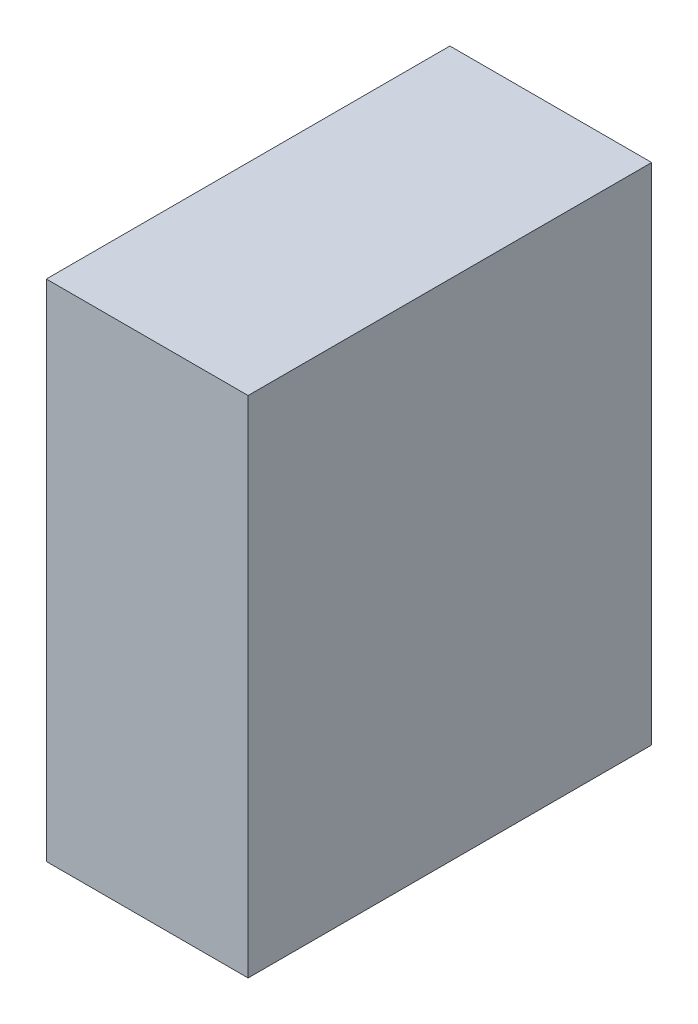
ISO-10303-21;
HEADER;
FILE_DESCRIPTION(('STEP AP214'),'2;1');
FILE_NAME('part.step','',(''),(''),'','','');
FILE_SCHEMA(('AUTOMOTIVE_DESIGN { 1 0 10303 214 1 1 1 1 }'));
ENDSEC;
DATA;
#1=APPLICATION_CONTEXT('core data for automotive mechanical design processes');
#2=APPLICATION_PROTOCOL_DEFINITION('international standard','automotive_design',2000,#1);
#3=PRODUCT_CONTEXT('',#1,'mechanical');
#4=PRODUCT('Part','Part','',(#3));
#5=PRODUCT_RELATED_PRODUCT_CATEGORY('part','',(#4));
#6=PRODUCT_DEFINITION_FORMATION('','',#4);
#7=PRODUCT_DEFINITION_CONTEXT('part definition',#1,'design');
#8=PRODUCT_DEFINITION('design','',#6,#7);
#9=PRODUCT_DEFINITION_SHAPE('','',#8);
#10=(LENGTH_UNIT() NAMED_UNIT(*) SI_UNIT(.MILLI.,.METRE.));
#11=(NAMED_UNIT(*) PLANE_ANGLE_UNIT() SI_UNIT($,.RADIAN.));
#12=(NAMED_UNIT(*) SI_UNIT($,.STERADIAN.) SOLID_ANGLE_UNIT());
#13=UNCERTAINTY_MEASURE_WITH_UNIT(LENGTH_MEASURE(1.E-05),#10,'distance_accuracy_value','');
#14=(GEOMETRIC_REPRESENTATION_CONTEXT(3) GLOBAL_UNCERTAINTY_ASSIGNED_CONTEXT((#13)) GLOBAL_UNIT_ASSIGNED_CONTEXT((#10,
#11,#12)) REPRESENTATION_CONTEXT('',''));
#15=CARTESIAN_POINT('',(0.,0.,0.));
#16=DIRECTION('',(0.,0.,1.));
#17=DIRECTION('',(1.,0.,0.));
#18=AXIS2_PLACEMENT_3D('',#15,#16,#17);
#19=CARTESIAN_POINT('',(-0.1999996,-0.499999,0.));
#20=DIRECTION('',(-1.,0.,0.));
#21=DIRECTION('',(0.,0.,1.));
#22=AXIS2_PLACEMENT_3D('',#19,#20,#21);
#23=PLANE('',#22);
#24=DIRECTION('',(0.,0.,1.));
#25=VECTOR('',#24,1.);
#26=CARTESIAN_POINT('',(-0.1999996,0.499999,0.));
#27=LINE('',#26,#25);
#28=CARTESIAN_POINT('',(-0.1999996,0.499999,0.));
#29=VERTEX_POINT('',#28);
#30=CARTESIAN_POINT('',(-0.1999996,0.499999,0.80000094));
#31=VERTEX_POINT('',#30);
#32=EDGE_CURVE('E20',#29,#31,#27,.T.);
#33=ORIENTED_EDGE('',*,*,#32,.F.);
#34=DIRECTION('',(0.,1.,0.));
#35=VECTOR('',#34,1.);
#36=CARTESIAN_POINT('',(-0.1999996,0.499999,0.));
#37=LINE('',#36,#35);
#38=CARTESIAN_POINT('',(-0.1999996,-0.499999,0.));
#39=VERTEX_POINT('',#38);
#40=EDGE_CURVE('E79',#29,#39,#37,.F.);
#41=ORIENTED_EDGE('',*,*,#40,.T.);
#42=DIRECTION('',(0.,0.,-1.));
#43=VECTOR('',#42,1.);
#44=CARTESIAN_POINT('',(-0.1999996,-0.499999,0.));
#45=LINE('',#44,#43);
#46=CARTESIAN_POINT('',(-0.1999996,-0.499999,0.80000094));
#47=VERTEX_POINT('',#46);
#48=EDGE_CURVE('E61',#47,#39,#45,.T.);
#49=ORIENTED_EDGE('',*,*,#48,.F.);
#50=DIRECTION('',(0.,1.,0.));
#51=VECTOR('',#50,1.);
#52=CARTESIAN_POINT('',(-0.1999996,0.499999,0.80000094));
#53=LINE('',#52,#51);
#54=EDGE_CURVE('E56',#31,#47,#53,.F.);
#55=ORIENTED_EDGE('',*,*,#54,.F.);
#56=EDGE_LOOP('',(#33,#41,#49,#55));
#57=FACE_BOUND('',#56,.T.);
#58=ADVANCED_FACE('F17',(#57),#23,.T.);
#59=CARTESIAN_POINT('',(-0.1999996,0.499999,0.));
#60=DIRECTION('',(0.,1.,0.));
#61=DIRECTION('',(0.,0.,1.));
#62=AXIS2_PLACEMENT_3D('',#59,#60,#61);
#63=PLANE('',#62);
#64=DIRECTION('',(0.,0.,-1.));
#65=VECTOR('',#64,1.);
#66=CARTESIAN_POINT('',(0.20000214,0.499999,0.));
#67=LINE('',#66,#65);
#68=CARTESIAN_POINT('',(0.20000214,0.499999,0.));
#69=VERTEX_POINT('',#68);
#70=CARTESIAN_POINT('',(0.20000214,0.499999,0.80000094));
#71=VERTEX_POINT('',#70);
#72=EDGE_CURVE('E83',#69,#71,#67,.F.);
#73=ORIENTED_EDGE('',*,*,#72,.F.);
#74=DIRECTION('',(1.,0.,0.));
#75=VECTOR('',#74,1.);
#76=CARTESIAN_POINT('',(-0.1999996,0.499999,0.));
#77=LINE('',#76,#75);
#78=EDGE_CURVE('E68',#69,#29,#77,.F.);
#79=ORIENTED_EDGE('',*,*,#78,.T.);
#80=ORIENTED_EDGE('',*,*,#32,.T.);
#81=DIRECTION('',(1.,0.,0.));
#82=VECTOR('',#81,1.);
#83=CARTESIAN_POINT('',(-0.1999996,0.499999,0.80000094));
#84=LINE('',#83,#82);
#85=EDGE_CURVE('E63',#71,#31,#84,.F.);
#86=ORIENTED_EDGE('',*,*,#85,.F.);
#87=EDGE_LOOP('',(#73,#79,#80,#86));
#88=FACE_BOUND('',#87,.T.);
#89=ADVANCED_FACE('F65',(#88),#63,.T.);
#90=CARTESIAN_POINT('',(-0.1999996,0.499999,0.80000094));
#91=DIRECTION('',(0.,0.,1.));
#92=DIRECTION('',(1.,0.,0.));
#93=AXIS2_PLACEMENT_3D('',#90,#91,#92);
#94=PLANE('',#93);
#95=DIRECTION('',(0.,1.,0.));
#96=VECTOR('',#95,1.);
#97=CARTESIAN_POINT('',(0.20000214,0.499999,0.80000094));
#98=LINE('',#97,#96);
#99=CARTESIAN_POINT('',(0.20000214,-0.499999,0.80000094));
#100=VERTEX_POINT('',#99);
#101=EDGE_CURVE('E72',#71,#100,#98,.F.);
#102=ORIENTED_EDGE('',*,*,#101,.F.);
#103=ORIENTED_EDGE('',*,*,#85,.T.);
#104=ORIENTED_EDGE('',*,*,#54,.T.);
#105=DIRECTION('',(1.,0.,0.));
#106=VECTOR('',#105,1.);
#107=CARTESIAN_POINT('',(0.20000214,-0.499999,0.80000094));
#108=LINE('',#107,#106);
#109=EDGE_CURVE('E74',#100,#47,#108,.F.);
#110=ORIENTED_EDGE('',*,*,#109,.F.);
#111=EDGE_LOOP('',(#102,#103,#104,#110));
#112=FACE_BOUND('',#111,.T.);
#113=ADVANCED_FACE('F70',(#112),#94,.T.);
#114=CARTESIAN_POINT('',(0.20000214,-0.499999,0.));
#115=DIRECTION('',(0.,-1.,0.));
#116=DIRECTION('',(0.,0.,-1.));
#117=AXIS2_PLACEMENT_3D('',#114,#115,#116);
#118=PLANE('',#117);
#119=ORIENTED_EDGE('',*,*,#48,.T.);
#120=DIRECTION('',(1.,0.,0.));
#121=VECTOR('',#120,1.);
#122=CARTESIAN_POINT('',(-0.1999996,-0.499999,0.));
#123=LINE('',#122,#121);
#124=CARTESIAN_POINT('',(0.20000214,-0.499999,0.));
#125=VERTEX_POINT('',#124);
#126=EDGE_CURVE('E35',#39,#125,#123,.T.);
#127=ORIENTED_EDGE('',*,*,#126,.T.);
#128=DIRECTION('',(0.,0.,-1.));
#129=VECTOR('',#128,1.);
#130=CARTESIAN_POINT('',(0.20000214,-0.499999,0.));
#131=LINE('',#130,#129);
#132=EDGE_CURVE('E26',#100,#125,#131,.T.);
#133=ORIENTED_EDGE('',*,*,#132,.F.);
#134=ORIENTED_EDGE('',*,*,#109,.T.);
#135=EDGE_LOOP('',(#119,#127,#133,#134));
#136=FACE_BOUND('',#135,.T.);
#137=ADVANCED_FACE('F89',(#136),#118,.T.);
#138=CARTESIAN_POINT('',(-0.1999996,0.499999,0.));
#139=DIRECTION('',(0.,0.,1.));
#140=DIRECTION('',(1.,0.,0.));
#141=AXIS2_PLACEMENT_3D('',#138,#139,#140);
#142=PLANE('',#141);
#143=DIRECTION('',(0.,1.,0.));
#144=VECTOR('',#143,1.);
#145=CARTESIAN_POINT('',(0.20000214,0.499999,0.));
#146=LINE('',#145,#144);
#147=EDGE_CURVE('E11',#125,#69,#146,.T.);
#148=ORIENTED_EDGE('',*,*,#147,.F.);
#149=ORIENTED_EDGE('',*,*,#126,.F.);
#150=ORIENTED_EDGE('',*,*,#40,.F.);
#151=ORIENTED_EDGE('',*,*,#78,.F.);
#152=EDGE_LOOP('',(#148,#149,#150,#151));
#153=FACE_BOUND('',#152,.T.);
#154=ADVANCED_FACE('F91',(#153),#142,.F.);
#155=CARTESIAN_POINT('',(0.20000214,0.499999,0.));
#156=DIRECTION('',(1.,0.,0.));
#157=DIRECTION('',(0.,0.,-1.));
#158=AXIS2_PLACEMENT_3D('',#155,#156,#157);
#159=PLANE('',#158);
#160=ORIENTED_EDGE('',*,*,#132,.T.);
#161=ORIENTED_EDGE('',*,*,#147,.T.);
#162=ORIENTED_EDGE('',*,*,#72,.T.);
#163=ORIENTED_EDGE('',*,*,#101,.T.);
#164=EDGE_LOOP('',(#160,#161,#162,#163));
#165=FACE_BOUND('',#164,.T.);
#166=ADVANCED_FACE('F88',(#165),#159,.T.);
#167=CLOSED_SHELL('',(#58,#89,#113,#137,#154,#166));
#168=MANIFOLD_SOLID_BREP('B1',#167);
#169=ADVANCED_BREP_SHAPE_REPRESENTATION('',(#18,#168),#14);
#170=SHAPE_DEFINITION_REPRESENTATION(#9,#169);
ENDSEC;
END-ISO-10303-21;
